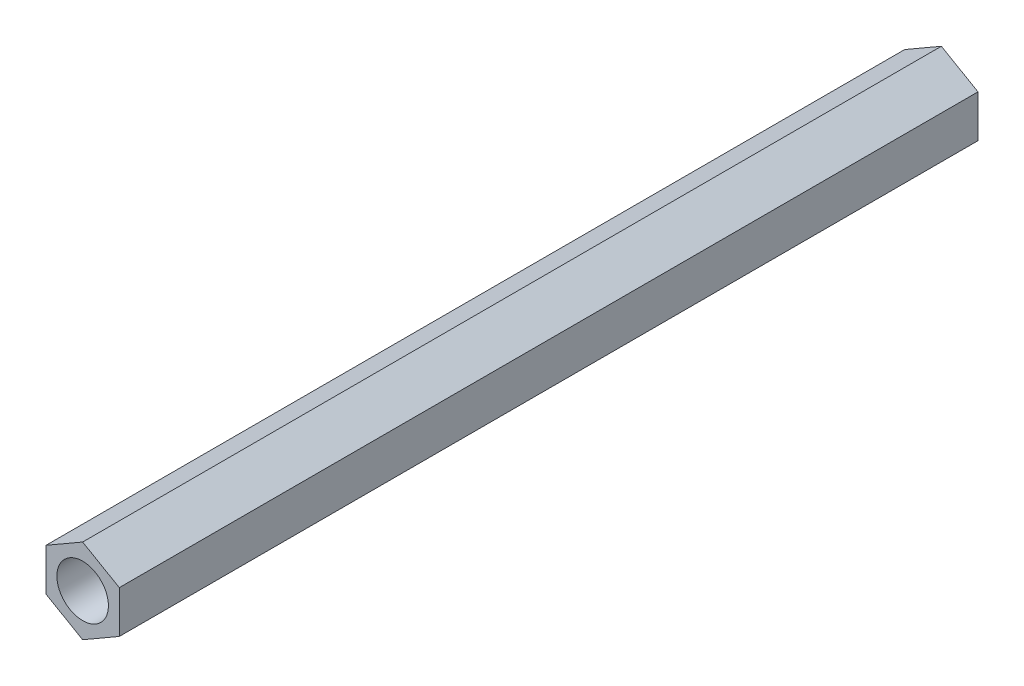
ISO-10303-21;
HEADER;
FILE_DESCRIPTION(('STEP AP214'),'2;1');
FILE_NAME('part.step','',(''),(''),'','','');
FILE_SCHEMA(('AUTOMOTIVE_DESIGN { 1 0 10303 214 1 1 1 1 }'));
ENDSEC;
DATA;
#1=APPLICATION_CONTEXT('core data for automotive mechanical design processes');
#2=APPLICATION_PROTOCOL_DEFINITION('international standard','automotive_design',2000,#1);
#3=PRODUCT_CONTEXT('',#1,'mechanical');
#4=PRODUCT('Part','Part','',(#3));
#5=PRODUCT_RELATED_PRODUCT_CATEGORY('part','',(#4));
#6=PRODUCT_DEFINITION_FORMATION('','',#4);
#7=PRODUCT_DEFINITION_CONTEXT('part definition',#1,'design');
#8=PRODUCT_DEFINITION('design','',#6,#7);
#9=PRODUCT_DEFINITION_SHAPE('','',#8);
#10=(LENGTH_UNIT() NAMED_UNIT(*) SI_UNIT(.MILLI.,.METRE.));
#11=(NAMED_UNIT(*) PLANE_ANGLE_UNIT() SI_UNIT($,.RADIAN.));
#12=(NAMED_UNIT(*) SI_UNIT($,.STERADIAN.) SOLID_ANGLE_UNIT());
#13=UNCERTAINTY_MEASURE_WITH_UNIT(LENGTH_MEASURE(1.E-05),#10,'distance_accuracy_value','');
#14=(GEOMETRIC_REPRESENTATION_CONTEXT(3) GLOBAL_UNCERTAINTY_ASSIGNED_CONTEXT((#13)) GLOBAL_UNIT_ASSIGNED_CONTEXT((#10,
#11,#12)) REPRESENTATION_CONTEXT('',''));
#15=CARTESIAN_POINT('',(0.,0.,0.));
#16=DIRECTION('',(0.,0.,1.));
#17=DIRECTION('',(1.,0.,0.));
#18=AXIS2_PLACEMENT_3D('',#15,#16,#17);
#19=CARTESIAN_POINT('',(0.,0.,50.));
#20=DIRECTION('',(0.,0.,1.));
#21=DIRECTION('',(1.,0.,0.));
#22=AXIS2_PLACEMENT_3D('',#19,#20,#21);
#23=PLANE('',#22);
#24=DIRECTION('',(-0.866025403784442,0.499999999999995,0.));
#25=VECTOR('',#24,1.);
#26=CARTESIAN_POINT('',(2.13382530169226,1.23196461233569,50.));
#27=LINE('',#26,#25);
#28=CARTESIAN_POINT('',(2.13382530169226,1.23196461233569,50.));
#29=VERTEX_POINT('',#28);
#30=CARTESIAN_POINT('',(0.,2.46392922467133,50.));
#31=VERTEX_POINT('',#30);
#32=EDGE_CURVE('E148',#29,#31,#27,.T.);
#33=ORIENTED_EDGE('',*,*,#32,.T.);
#34=DIRECTION('',(-0.866025403784438,-0.500000000000001,0.));
#35=VECTOR('',#34,1.);
#36=CARTESIAN_POINT('',(0.,2.46392922467133,50.));
#37=LINE('',#36,#35);
#38=CARTESIAN_POINT('',(-2.13382530169227,1.23196461233566,50.));
#39=VERTEX_POINT('',#38);
#40=EDGE_CURVE('E96',#31,#39,#37,.T.);
#41=ORIENTED_EDGE('',*,*,#40,.T.);
#42=DIRECTION('',(0.,-1.,0.));
#43=VECTOR('',#42,1.);
#44=CARTESIAN_POINT('',(-2.13382530169227,1.23196461233566,50.));
#45=LINE('',#44,#43);
#46=CARTESIAN_POINT('',(-2.13382530169226,-1.23196461233568,50.));
#47=VERTEX_POINT('',#46);
#48=EDGE_CURVE('E109',#39,#47,#45,.T.);
#49=ORIENTED_EDGE('',*,*,#48,.T.);
#50=DIRECTION('',(0.866025403784442,-0.499999999999995,0.));
#51=VECTOR('',#50,1.);
#52=CARTESIAN_POINT('',(-2.13382530169226,-1.23196461233568,50.));
#53=LINE('',#52,#51);
#54=CARTESIAN_POINT('',(0.,-2.46392922467133,50.));
#55=VERTEX_POINT('',#54);
#56=EDGE_CURVE('E103',#47,#55,#53,.T.);
#57=ORIENTED_EDGE('',*,*,#56,.T.);
#58=DIRECTION('',(0.866025403784434,0.500000000000007,0.));
#59=VECTOR('',#58,1.);
#60=CARTESIAN_POINT('',(0.,-2.46392922467133,50.));
#61=LINE('',#60,#59);
#62=CARTESIAN_POINT('',(2.13382530169228,-1.23196461233565,50.));
#63=VERTEX_POINT('',#62);
#64=EDGE_CURVE('E107',#55,#63,#61,.T.);
#65=ORIENTED_EDGE('',*,*,#64,.T.);
#66=DIRECTION('',(0.,1.,0.));
#67=VECTOR('',#66,1.);
#68=CARTESIAN_POINT('',(2.13382530169228,-1.23196461233565,50.));
#69=LINE('',#68,#67);
#70=EDGE_CURVE('E59',#63,#29,#69,.T.);
#71=ORIENTED_EDGE('',*,*,#70,.T.);
#72=EDGE_LOOP('',(#33,#41,#49,#57,#65,#71));
#73=FACE_BOUND('',#72,.T.);
#74=CARTESIAN_POINT('',(0.,0.,50.));
#75=DIRECTION('',(0.,0.,1.));
#76=DIRECTION('',(1.,0.,0.));
#77=AXIS2_PLACEMENT_3D('',#74,#75,#76);
#78=CIRCLE('',#77,1.5);
#79=CARTESIAN_POINT('',(1.5,0.,50.));
#80=VERTEX_POINT('',#79);
#81=EDGE_CURVE('E136',#80,#80,#78,.T.);
#82=ORIENTED_EDGE('',*,*,#81,.F.);
#83=EDGE_LOOP('',(#82));
#84=FACE_BOUND('',#83,.T.);
#85=ADVANCED_FACE('F41',(#73,#84),#23,.T.);
#86=CARTESIAN_POINT('',(0.,0.,0.));
#87=DIRECTION('',(0.,0.,1.));
#88=DIRECTION('',(1.,0.,0.));
#89=AXIS2_PLACEMENT_3D('',#86,#87,#88);
#90=PLANE('',#89);
#91=DIRECTION('',(-0.866025403784442,0.499999999999995,0.));
#92=VECTOR('',#91,1.);
#93=CARTESIAN_POINT('',(2.13382530169226,1.23196461233569,0.));
#94=LINE('',#93,#92);
#95=CARTESIAN_POINT('',(2.13382530169226,1.23196461233569,0.));
#96=VERTEX_POINT('',#95);
#97=CARTESIAN_POINT('',(0.,2.46392922467133,0.));
#98=VERTEX_POINT('',#97);
#99=EDGE_CURVE('E131',#96,#98,#94,.T.);
#100=ORIENTED_EDGE('',*,*,#99,.F.);
#101=DIRECTION('',(0.,1.,0.));
#102=VECTOR('',#101,1.);
#103=CARTESIAN_POINT('',(2.13382530169228,-1.23196461233565,0.));
#104=LINE('',#103,#102);
#105=CARTESIAN_POINT('',(2.13382530169228,-1.23196461233565,0.));
#106=VERTEX_POINT('',#105);
#107=EDGE_CURVE('E88',#106,#96,#104,.T.);
#108=ORIENTED_EDGE('',*,*,#107,.F.);
#109=DIRECTION('',(0.866025403784434,0.500000000000007,0.));
#110=VECTOR('',#109,1.);
#111=CARTESIAN_POINT('',(0.,-2.46392922467133,0.));
#112=LINE('',#111,#110);
#113=CARTESIAN_POINT('',(0.,-2.46392922467133,0.));
#114=VERTEX_POINT('',#113);
#115=EDGE_CURVE('E82',#114,#106,#112,.T.);
#116=ORIENTED_EDGE('',*,*,#115,.F.);
#117=DIRECTION('',(0.866025403784442,-0.499999999999995,0.));
#118=VECTOR('',#117,1.);
#119=CARTESIAN_POINT('',(-2.13382530169226,-1.23196461233568,0.));
#120=LINE('',#119,#118);
#121=CARTESIAN_POINT('',(-2.13382530169226,-1.23196461233568,0.));
#122=VERTEX_POINT('',#121);
#123=EDGE_CURVE('E118',#122,#114,#120,.T.);
#124=ORIENTED_EDGE('',*,*,#123,.F.);
#125=DIRECTION('',(0.,-1.,0.));
#126=VECTOR('',#125,1.);
#127=CARTESIAN_POINT('',(-2.13382530169227,1.23196461233566,0.));
#128=LINE('',#127,#126);
#129=CARTESIAN_POINT('',(-2.13382530169227,1.23196461233566,0.));
#130=VERTEX_POINT('',#129);
#131=EDGE_CURVE('E139',#130,#122,#128,.T.);
#132=ORIENTED_EDGE('',*,*,#131,.F.);
#133=DIRECTION('',(-0.866025403784438,-0.500000000000001,0.));
#134=VECTOR('',#133,1.);
#135=CARTESIAN_POINT('',(0.,2.46392922467133,0.));
#136=LINE('',#135,#134);
#137=EDGE_CURVE('E135',#98,#130,#136,.T.);
#138=ORIENTED_EDGE('',*,*,#137,.F.);
#139=EDGE_LOOP('',(#100,#108,#116,#124,#132,#138));
#140=FACE_BOUND('',#139,.T.);
#141=CARTESIAN_POINT('',(0.,0.,0.));
#142=DIRECTION('',(0.,0.,1.));
#143=DIRECTION('',(1.,0.,0.));
#144=AXIS2_PLACEMENT_3D('',#141,#142,#143);
#145=CIRCLE('',#144,1.5);
#146=CARTESIAN_POINT('',(1.5,0.,0.));
#147=VERTEX_POINT('',#146);
#148=EDGE_CURVE('E245',#147,#147,#145,.T.);
#149=ORIENTED_EDGE('',*,*,#148,.T.);
#150=EDGE_LOOP('',(#149));
#151=FACE_BOUND('',#150,.T.);
#152=ADVANCED_FACE('F161',(#140,#151),#90,.F.);
#153=CARTESIAN_POINT('',(2.13382530169226,1.23196461233569,50.));
#154=DIRECTION('',(-0.499999999999995,-0.866025403784442,0.));
#155=DIRECTION('',(0.866025403784442,-0.499999999999995,0.));
#156=AXIS2_PLACEMENT_3D('',#153,#154,#155);
#157=PLANE('',#156);
#158=ORIENTED_EDGE('',*,*,#99,.T.);
#159=DIRECTION('',(0.,0.,-1.));
#160=VECTOR('',#159,1.);
#161=CARTESIAN_POINT('',(0.,2.46392922467133,50.));
#162=LINE('',#161,#160);
#163=EDGE_CURVE('E11',#31,#98,#162,.T.);
#164=ORIENTED_EDGE('',*,*,#163,.F.);
#165=ORIENTED_EDGE('',*,*,#32,.F.);
#166=DIRECTION('',(0.,0.,-1.));
#167=VECTOR('',#166,1.);
#168=CARTESIAN_POINT('',(2.13382530169226,1.23196461233569,50.));
#169=LINE('',#168,#167);
#170=EDGE_CURVE('E127',#29,#96,#169,.T.);
#171=ORIENTED_EDGE('',*,*,#170,.T.);
#172=EDGE_LOOP('',(#158,#164,#165,#171));
#173=FACE_BOUND('',#172,.T.);
#174=ADVANCED_FACE('F43',(#173),#157,.F.);
#175=CARTESIAN_POINT('',(0.,2.46392922467133,50.));
#176=DIRECTION('',(0.500000000000001,-0.866025403784438,0.));
#177=DIRECTION('',(0.866025403784438,0.500000000000001,0.));
#178=AXIS2_PLACEMENT_3D('',#175,#176,#177);
#179=PLANE('',#178);
#180=ORIENTED_EDGE('',*,*,#137,.T.);
#181=DIRECTION('',(0.,0.,-1.));
#182=VECTOR('',#181,1.);
#183=CARTESIAN_POINT('',(-2.13382530169227,1.23196461233566,50.));
#184=LINE('',#183,#182);
#185=EDGE_CURVE('E51',#39,#130,#184,.T.);
#186=ORIENTED_EDGE('',*,*,#185,.F.);
#187=ORIENTED_EDGE('',*,*,#40,.F.);
#188=ORIENTED_EDGE('',*,*,#163,.T.);
#189=EDGE_LOOP('',(#180,#186,#187,#188));
#190=FACE_BOUND('',#189,.T.);
#191=ADVANCED_FACE('F186',(#190),#179,.F.);
#192=CARTESIAN_POINT('',(-2.13382530169227,1.23196461233566,50.));
#193=DIRECTION('',(1.,0.,0.));
#194=DIRECTION('',(0.,1.,0.));
#195=AXIS2_PLACEMENT_3D('',#192,#193,#194);
#196=PLANE('',#195);
#197=ORIENTED_EDGE('',*,*,#131,.T.);
#198=DIRECTION('',(0.,0.,-1.));
#199=VECTOR('',#198,1.);
#200=CARTESIAN_POINT('',(-2.13382530169226,-1.23196461233568,50.));
#201=LINE('',#200,#199);
#202=EDGE_CURVE('E120',#47,#122,#201,.T.);
#203=ORIENTED_EDGE('',*,*,#202,.F.);
#204=ORIENTED_EDGE('',*,*,#48,.F.);
#205=ORIENTED_EDGE('',*,*,#185,.T.);
#206=EDGE_LOOP('',(#197,#203,#204,#205));
#207=FACE_BOUND('',#206,.T.);
#208=ADVANCED_FACE('F158',(#207),#196,.F.);
#209=CARTESIAN_POINT('',(-2.13382530169226,-1.23196461233568,50.));
#210=DIRECTION('',(0.499999999999995,0.866025403784442,0.));
#211=DIRECTION('',(-0.866025403784442,0.499999999999995,0.));
#212=AXIS2_PLACEMENT_3D('',#209,#210,#211);
#213=PLANE('',#212);
#214=ORIENTED_EDGE('',*,*,#123,.T.);
#215=DIRECTION('',(0.,0.,-1.));
#216=VECTOR('',#215,1.);
#217=CARTESIAN_POINT('',(0.,-2.46392922467133,50.));
#218=LINE('',#217,#216);
#219=EDGE_CURVE('E115',#55,#114,#218,.T.);
#220=ORIENTED_EDGE('',*,*,#219,.F.);
#221=ORIENTED_EDGE('',*,*,#56,.F.);
#222=ORIENTED_EDGE('',*,*,#202,.T.);
#223=EDGE_LOOP('',(#214,#220,#221,#222));
#224=FACE_BOUND('',#223,.T.);
#225=ADVANCED_FACE('F116',(#224),#213,.F.);
#226=CARTESIAN_POINT('',(0.,-2.46392922467133,50.));
#227=DIRECTION('',(-0.500000000000007,0.866025403784434,0.));
#228=DIRECTION('',(-0.866025403784435,-0.500000000000007,0.));
#229=AXIS2_PLACEMENT_3D('',#226,#227,#228);
#230=PLANE('',#229);
#231=ORIENTED_EDGE('',*,*,#115,.T.);
#232=DIRECTION('',(0.,0.,-1.));
#233=VECTOR('',#232,1.);
#234=CARTESIAN_POINT('',(2.13382530169228,-1.23196461233565,50.));
#235=LINE('',#234,#233);
#236=EDGE_CURVE('E121',#63,#106,#235,.T.);
#237=ORIENTED_EDGE('',*,*,#236,.F.);
#238=ORIENTED_EDGE('',*,*,#64,.F.);
#239=ORIENTED_EDGE('',*,*,#219,.T.);
#240=EDGE_LOOP('',(#231,#237,#238,#239));
#241=FACE_BOUND('',#240,.T.);
#242=ADVANCED_FACE('F123',(#241),#230,.F.);
#243=CARTESIAN_POINT('',(2.13382530169228,-1.23196461233565,50.));
#244=DIRECTION('',(-1.,0.,0.));
#245=DIRECTION('',(0.,-1.,0.));
#246=AXIS2_PLACEMENT_3D('',#243,#244,#245);
#247=PLANE('',#246);
#248=ORIENTED_EDGE('',*,*,#107,.T.);
#249=ORIENTED_EDGE('',*,*,#170,.F.);
#250=ORIENTED_EDGE('',*,*,#70,.F.);
#251=ORIENTED_EDGE('',*,*,#236,.T.);
#252=EDGE_LOOP('',(#248,#249,#250,#251));
#253=FACE_BOUND('',#252,.T.);
#254=ADVANCED_FACE('F166',(#253),#247,.F.);
#255=CARTESIAN_POINT('',(0.,0.,50.));
#256=DIRECTION('',(0.,0.,-1.));
#257=DIRECTION('',(-1.,0.,0.));
#258=AXIS2_PLACEMENT_3D('',#255,#256,#257);
#259=CYLINDRICAL_SURFACE('',#258,1.5);
#260=ORIENTED_EDGE('',*,*,#81,.T.);
#261=EDGE_LOOP('',(#260));
#262=FACE_BOUND('',#261,.T.);
#263=ORIENTED_EDGE('',*,*,#148,.F.);
#264=EDGE_LOOP('',(#263));
#265=FACE_BOUND('',#264,.T.);
#266=ADVANCED_FACE('F168',(#262,#265),#259,.F.);
#267=CLOSED_SHELL('',(#85,#152,#174,#191,#208,#225,#242,#254,#266));
#268=MANIFOLD_SOLID_BREP('B2',#267);
#269=ADVANCED_BREP_SHAPE_REPRESENTATION('',(#18,#268),#14);
#270=SHAPE_DEFINITION_REPRESENTATION(#9,#269);
ENDSEC;
END-ISO-10303-21;
